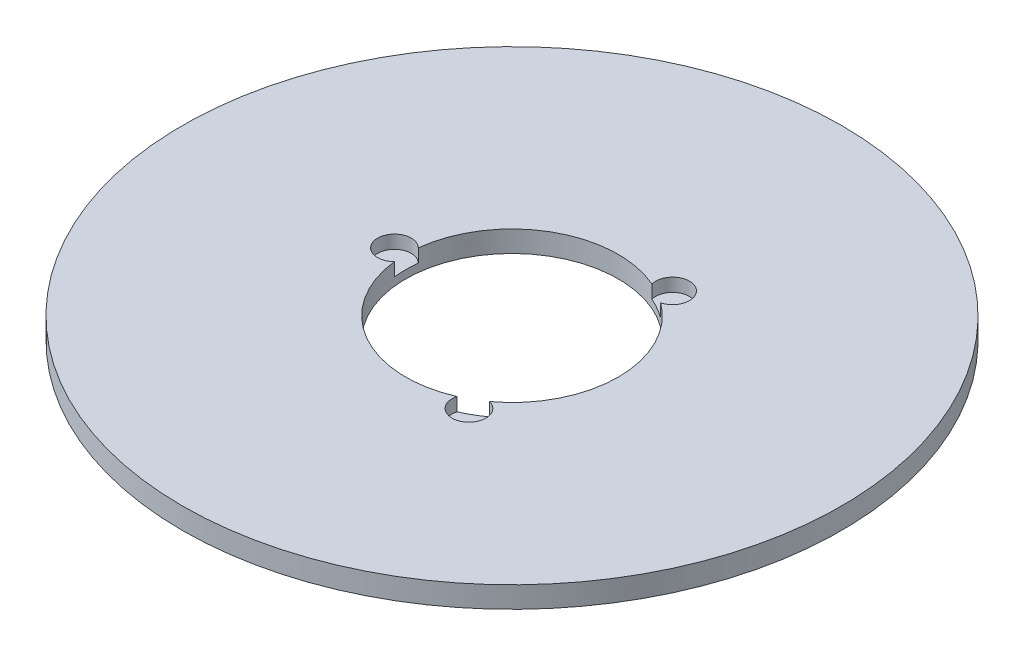
ISO-10303-21;
HEADER;
FILE_DESCRIPTION(('STEP AP214'),'2;1');
FILE_NAME('part.step','',(''),(''),'','','');
FILE_SCHEMA(('AUTOMOTIVE_DESIGN { 1 0 10303 214 1 1 1 1 }'));
ENDSEC;
DATA;
#1=APPLICATION_CONTEXT('core data for automotive mechanical design processes');
#2=APPLICATION_PROTOCOL_DEFINITION('international standard','automotive_design',2000,#1);
#3=PRODUCT_CONTEXT('',#1,'mechanical');
#4=PRODUCT('Part','Part','',(#3));
#5=PRODUCT_RELATED_PRODUCT_CATEGORY('part','',(#4));
#6=PRODUCT_DEFINITION_FORMATION('','',#4);
#7=PRODUCT_DEFINITION_CONTEXT('part definition',#1,'design');
#8=PRODUCT_DEFINITION('design','',#6,#7);
#9=PRODUCT_DEFINITION_SHAPE('','',#8);
#10=(LENGTH_UNIT() NAMED_UNIT(*) SI_UNIT(.MILLI.,.METRE.));
#11=(NAMED_UNIT(*) PLANE_ANGLE_UNIT() SI_UNIT($,.RADIAN.));
#12=(NAMED_UNIT(*) SI_UNIT($,.STERADIAN.) SOLID_ANGLE_UNIT());
#13=UNCERTAINTY_MEASURE_WITH_UNIT(LENGTH_MEASURE(1.E-05),#10,'distance_accuracy_value','');
#14=(GEOMETRIC_REPRESENTATION_CONTEXT(3) GLOBAL_UNCERTAINTY_ASSIGNED_CONTEXT((#13)) GLOBAL_UNIT_ASSIGNED_CONTEXT((#10,
#11,#12)) REPRESENTATION_CONTEXT('',''));
#15=CARTESIAN_POINT('',(0.,0.,0.));
#16=DIRECTION('',(0.,0.,1.));
#17=DIRECTION('',(1.,0.,0.));
#18=AXIS2_PLACEMENT_3D('',#15,#16,#17);
#19=CARTESIAN_POINT('',(0.,5.,0.));
#20=DIRECTION('',(0.,-1.,0.));
#21=DIRECTION('',(0.,0.,-1.));
#22=AXIS2_PLACEMENT_3D('',#19,#20,#21);
#23=CYLINDRICAL_SURFACE('',#22,77.5);
#24=CARTESIAN_POINT('',(0.,5.,0.));
#25=DIRECTION('',(0.,1.,0.));
#26=DIRECTION('',(0.,0.,1.));
#27=AXIS2_PLACEMENT_3D('',#24,#25,#26);
#28=CIRCLE('',#27,77.5);
#29=CARTESIAN_POINT('',(0.,5.,77.5));
#30=VERTEX_POINT('',#29);
#31=EDGE_CURVE('E126',#30,#30,#28,.T.);
#32=ORIENTED_EDGE('',*,*,#31,.F.);
#33=EDGE_LOOP('',(#32));
#34=FACE_BOUND('',#33,.T.);
#35=CARTESIAN_POINT('',(0.,0.,0.));
#36=DIRECTION('',(0.,1.,0.));
#37=DIRECTION('',(0.,0.,1.));
#38=AXIS2_PLACEMENT_3D('',#35,#36,#37);
#39=CIRCLE('',#38,77.5);
#40=CARTESIAN_POINT('',(0.,0.,77.5));
#41=VERTEX_POINT('',#40);
#42=EDGE_CURVE('E124',#41,#41,#39,.T.);
#43=ORIENTED_EDGE('',*,*,#42,.T.);
#44=EDGE_LOOP('',(#43));
#45=FACE_BOUND('',#44,.T.);
#46=ADVANCED_FACE('F39',(#34,#45),#23,.T.);
#47=CARTESIAN_POINT('',(0.,5.,0.));
#48=DIRECTION('',(0.,1.,0.));
#49=DIRECTION('',(0.,0.,1.));
#50=AXIS2_PLACEMENT_3D('',#47,#48,#49);
#51=PLANE('',#50);
#52=CARTESIAN_POINT('',(13.8231584113767,5.,23.9424126895773));
#53=DIRECTION('',(0.,1.,0.));
#54=DIRECTION('',(0.866025403784436,0.,-0.500000000000004));
#55=AXIS2_PLACEMENT_3D('',#52,#53,#54);
#56=CIRCLE('',#55,3.96825472436484);
#57=CARTESIAN_POINT('',(9.98956244592138,5.,22.917430967258));
#58=VERTEX_POINT('',#57);
#59=CARTESIAN_POINT('',(14.8522961841611,5.,20.1099303344878));
#60=VERTEX_POINT('',#59);
#61=EDGE_CURVE('E147',#58,#60,#56,.T.);
#62=ORIENTED_EDGE('',*,*,#61,.F.);
#63=CARTESIAN_POINT('',(0.,5.,0.));
#64=DIRECTION('',(0.,1.,0.));
#65=DIRECTION('',(0.,0.,1.));
#66=AXIS2_PLACEMENT_3D('',#63,#64,#65);
#67=CIRCLE('',#66,25.);
#68=CARTESIAN_POINT('',(-24.8418586300823,5.,2.8075006327702));
#69=VERTEX_POINT('',#68);
#70=EDGE_CURVE('E118',#69,#58,#67,.T.);
#71=ORIENTED_EDGE('',*,*,#70,.F.);
#72=CARTESIAN_POINT('',(-27.6463168227532,5.,0.));
#73=DIRECTION('',(0.,1.,0.));
#74=DIRECTION('',(0.,0.,1.));
#75=AXIS2_PLACEMENT_3D('',#72,#73,#74);
#76=CIRCLE('',#75,3.96825472436484);
#77=CARTESIAN_POINT('',(-24.8418586300823,5.,-2.8075006327702));
#78=VERTEX_POINT('',#77);
#79=EDGE_CURVE('E113',#78,#69,#76,.T.);
#80=ORIENTED_EDGE('',*,*,#79,.F.);
#81=CARTESIAN_POINT('',(9.98956244592106,5.,-22.9174309672582));
#82=VERTEX_POINT('',#81);
#83=EDGE_CURVE('E106',#82,#78,#67,.T.);
#84=ORIENTED_EDGE('',*,*,#83,.F.);
#85=CARTESIAN_POINT('',(13.8231584113764,5.,-23.9424126895775));
#86=DIRECTION('',(0.,1.,0.));
#87=DIRECTION('',(-0.866025403784443,0.,-0.499999999999992));
#88=AXIS2_PLACEMENT_3D('',#85,#86,#87);
#89=CIRCLE('',#88,3.96825472436484);
#90=CARTESIAN_POINT('',(14.8522961841609,5.,-20.109930334488));
#91=VERTEX_POINT('',#90);
#92=EDGE_CURVE('E90',#91,#82,#89,.T.);
#93=ORIENTED_EDGE('',*,*,#92,.F.);
#94=EDGE_CURVE('E116',#60,#91,#67,.T.);
#95=ORIENTED_EDGE('',*,*,#94,.F.);
#96=EDGE_LOOP('',(#62,#71,#80,#84,#93,#95));
#97=FACE_BOUND('',#96,.T.);
#98=ORIENTED_EDGE('',*,*,#31,.T.);
#99=EDGE_LOOP('',(#98));
#100=FACE_BOUND('',#99,.T.);
#101=ADVANCED_FACE('F115',(#97,#100),#51,.T.);
#102=CARTESIAN_POINT('',(0.,0.,0.));
#103=DIRECTION('',(0.,1.,0.));
#104=DIRECTION('',(0.,0.,1.));
#105=AXIS2_PLACEMENT_3D('',#102,#103,#104);
#106=PLANE('',#105);
#107=CARTESIAN_POINT('',(0.,0.,0.));
#108=DIRECTION('',(0.,1.,0.));
#109=DIRECTION('',(0.,0.,1.));
#110=AXIS2_PLACEMENT_3D('',#107,#108,#109);
#111=CIRCLE('',#110,25.);
#112=CARTESIAN_POINT('',(0.,0.,25.));
#113=VERTEX_POINT('',#112);
#114=EDGE_CURVE('E120',#113,#113,#111,.T.);
#115=ORIENTED_EDGE('',*,*,#114,.T.);
#116=EDGE_LOOP('',(#115));
#117=FACE_BOUND('',#116,.T.);
#118=ORIENTED_EDGE('',*,*,#42,.F.);
#119=EDGE_LOOP('',(#118));
#120=FACE_BOUND('',#119,.T.);
#121=ADVANCED_FACE('F164',(#117,#120),#106,.F.);
#122=CARTESIAN_POINT('',(0.,5.,0.));
#123=DIRECTION('',(0.,-1.,0.));
#124=DIRECTION('',(0.,0.,-1.));
#125=AXIS2_PLACEMENT_3D('',#122,#123,#124);
#126=CYLINDRICAL_SURFACE('',#125,25.);
#127=DIRECTION('',(0.,1.,0.));
#128=VECTOR('',#127,1.);
#129=CARTESIAN_POINT('',(9.98956244592138,3.44371767161285,22.917430967258));
#130=LINE('',#129,#128);
#131=CARTESIAN_POINT('',(9.98956244592138,1.88743534322571,22.917430967258));
#132=VERTEX_POINT('',#131);
#133=EDGE_CURVE('E11',#132,#58,#130,.T.);
#134=ORIENTED_EDGE('',*,*,#133,.F.);
#135=CARTESIAN_POINT('',(0.,1.88743534322571,0.));
#136=DIRECTION('',(0.,1.,0.));
#137=DIRECTION('',(0.,0.,1.));
#138=AXIS2_PLACEMENT_3D('',#135,#136,#137);
#139=CIRCLE('',#138,25.);
#140=CARTESIAN_POINT('',(14.8522961841611,1.88743534322571,20.1099303344878));
#141=VERTEX_POINT('',#140);
#142=EDGE_CURVE('E144',#132,#141,#139,.T.);
#143=ORIENTED_EDGE('',*,*,#142,.T.);
#144=DIRECTION('',(0.,1.,0.));
#145=VECTOR('',#144,1.);
#146=CARTESIAN_POINT('',(14.8522961841611,3.44371767161285,20.1099303344878));
#147=LINE('',#146,#145);
#148=EDGE_CURVE('E46',#60,#141,#147,.F.);
#149=ORIENTED_EDGE('',*,*,#148,.F.);
#150=ORIENTED_EDGE('',*,*,#94,.T.);
#151=DIRECTION('',(0.,1.,0.));
#152=VECTOR('',#151,1.);
#153=CARTESIAN_POINT('',(14.8522961841609,3.44371767161285,-20.109930334488));
#154=LINE('',#153,#152);
#155=CARTESIAN_POINT('',(14.8522961841609,1.88743534322571,-20.109930334488));
#156=VERTEX_POINT('',#155);
#157=EDGE_CURVE('E92',#156,#91,#154,.T.);
#158=ORIENTED_EDGE('',*,*,#157,.F.);
#159=CARTESIAN_POINT('',(0.,1.88743534322571,0.));
#160=DIRECTION('',(0.,1.,0.));
#161=DIRECTION('',(0.,0.,1.));
#162=AXIS2_PLACEMENT_3D('',#159,#160,#161);
#163=CIRCLE('',#162,25.);
#164=CARTESIAN_POINT('',(9.98956244592106,1.88743534322571,-22.9174309672582));
#165=VERTEX_POINT('',#164);
#166=EDGE_CURVE('E107',#156,#165,#163,.T.);
#167=ORIENTED_EDGE('',*,*,#166,.T.);
#168=DIRECTION('',(0.,1.,0.));
#169=VECTOR('',#168,1.);
#170=CARTESIAN_POINT('',(9.98956244592106,3.44371767161285,-22.9174309672582));
#171=LINE('',#170,#169);
#172=EDGE_CURVE('E95',#82,#165,#171,.F.);
#173=ORIENTED_EDGE('',*,*,#172,.F.);
#174=ORIENTED_EDGE('',*,*,#83,.T.);
#175=DIRECTION('',(0.,1.,0.));
#176=VECTOR('',#175,1.);
#177=CARTESIAN_POINT('',(-24.8418586300823,3.44371767161285,-2.80750063277021));
#178=LINE('',#177,#176);
#179=CARTESIAN_POINT('',(-24.8418586300823,1.88743534322571,-2.8075006327702));
#180=VERTEX_POINT('',#179);
#181=EDGE_CURVE('E143',#180,#78,#178,.T.);
#182=ORIENTED_EDGE('',*,*,#181,.F.);
#183=CARTESIAN_POINT('',(0.,1.88743534322571,0.));
#184=DIRECTION('',(0.,1.,0.));
#185=DIRECTION('',(0.,0.,1.));
#186=AXIS2_PLACEMENT_3D('',#183,#184,#185);
#187=CIRCLE('',#186,25.);
#188=CARTESIAN_POINT('',(-24.8418586300823,1.88743534322571,2.8075006327702));
#189=VERTEX_POINT('',#188);
#190=EDGE_CURVE('E132',#180,#189,#187,.T.);
#191=ORIENTED_EDGE('',*,*,#190,.T.);
#192=DIRECTION('',(0.,1.,0.));
#193=VECTOR('',#192,1.);
#194=CARTESIAN_POINT('',(-24.8418586300823,3.44371767161285,2.80750063277021));
#195=LINE('',#194,#193);
#196=EDGE_CURVE('E137',#69,#189,#195,.F.);
#197=ORIENTED_EDGE('',*,*,#196,.F.);
#198=ORIENTED_EDGE('',*,*,#70,.T.);
#199=EDGE_LOOP('',(#134,#143,#149,#150,#158,#167,#173,#174,#182,#191,#197,#198));
#200=FACE_BOUND('',#199,.T.);
#201=ORIENTED_EDGE('',*,*,#114,.F.);
#202=EDGE_LOOP('',(#201));
#203=FACE_BOUND('',#202,.T.);
#204=ADVANCED_FACE('F103',(#200,#203),#126,.F.);
#205=CARTESIAN_POINT('',(-27.6463168227532,1.88743534322571,0.));
#206=DIRECTION('',(0.,1.,0.));
#207=DIRECTION('',(0.,0.,1.));
#208=AXIS2_PLACEMENT_3D('',#205,#206,#207);
#209=CYLINDRICAL_SURFACE('',#208,3.96825472436484);
#210=ORIENTED_EDGE('',*,*,#181,.T.);
#211=ORIENTED_EDGE('',*,*,#79,.T.);
#212=ORIENTED_EDGE('',*,*,#196,.T.);
#213=CARTESIAN_POINT('',(-27.6463168227532,1.88743534322571,0.));
#214=DIRECTION('',(0.,1.,0.));
#215=DIRECTION('',(0.,0.,1.));
#216=AXIS2_PLACEMENT_3D('',#213,#214,#215);
#217=CIRCLE('',#216,3.96825472436484);
#218=EDGE_CURVE('E121',#180,#189,#217,.T.);
#219=ORIENTED_EDGE('',*,*,#218,.F.);
#220=EDGE_LOOP('',(#210,#211,#212,#219));
#221=FACE_BOUND('',#220,.T.);
#222=ADVANCED_FACE('F174',(#221),#209,.F.);
#223=CARTESIAN_POINT('',(-27.6463168227532,1.88743534322571,0.));
#224=DIRECTION('',(0.,1.,0.));
#225=DIRECTION('',(0.,0.,1.));
#226=AXIS2_PLACEMENT_3D('',#223,#224,#225);
#227=PLANE('',#226);
#228=ORIENTED_EDGE('',*,*,#218,.T.);
#229=ORIENTED_EDGE('',*,*,#190,.F.);
#230=EDGE_LOOP('',(#228,#229));
#231=FACE_BOUND('',#230,.T.);
#232=ADVANCED_FACE('F177',(#231),#227,.T.);
#233=CARTESIAN_POINT('',(13.8231584113764,1.88743534322571,-23.9424126895775));
#234=DIRECTION('',(0.,1.,0.));
#235=DIRECTION('',(0.,0.,1.));
#236=AXIS2_PLACEMENT_3D('',#233,#234,#235);
#237=CYLINDRICAL_SURFACE('',#236,3.96825472436484);
#238=ORIENTED_EDGE('',*,*,#157,.T.);
#239=ORIENTED_EDGE('',*,*,#92,.T.);
#240=ORIENTED_EDGE('',*,*,#172,.T.);
#241=CARTESIAN_POINT('',(13.8231584113764,1.88743534322571,-23.9424126895775));
#242=DIRECTION('',(0.,1.,0.));
#243=DIRECTION('',(-0.866025403784443,0.,-0.499999999999992));
#244=AXIS2_PLACEMENT_3D('',#241,#242,#243);
#245=CIRCLE('',#244,3.96825472436484);
#246=EDGE_CURVE('E56',#156,#165,#245,.T.);
#247=ORIENTED_EDGE('',*,*,#246,.F.);
#248=EDGE_LOOP('',(#238,#239,#240,#247));
#249=FACE_BOUND('',#248,.T.);
#250=ADVANCED_FACE('F93',(#249),#237,.F.);
#251=CARTESIAN_POINT('',(13.8231584113764,1.88743534322571,-23.9424126895775));
#252=DIRECTION('',(0.,1.,0.));
#253=DIRECTION('',(-0.866025403784443,0.,-0.499999999999992));
#254=AXIS2_PLACEMENT_3D('',#251,#252,#253);
#255=PLANE('',#254);
#256=ORIENTED_EDGE('',*,*,#246,.T.);
#257=ORIENTED_EDGE('',*,*,#166,.F.);
#258=EDGE_LOOP('',(#256,#257));
#259=FACE_BOUND('',#258,.T.);
#260=ADVANCED_FACE('F160',(#259),#255,.T.);
#261=CARTESIAN_POINT('',(13.8231584113767,1.88743534322571,23.9424126895773));
#262=DIRECTION('',(0.,1.,0.));
#263=DIRECTION('',(0.,0.,1.));
#264=AXIS2_PLACEMENT_3D('',#261,#262,#263);
#265=CYLINDRICAL_SURFACE('',#264,3.96825472436484);
#266=ORIENTED_EDGE('',*,*,#133,.T.);
#267=ORIENTED_EDGE('',*,*,#61,.T.);
#268=ORIENTED_EDGE('',*,*,#148,.T.);
#269=CARTESIAN_POINT('',(13.8231584113767,1.88743534322571,23.9424126895773));
#270=DIRECTION('',(0.,1.,0.));
#271=DIRECTION('',(0.866025403784436,0.,-0.500000000000004));
#272=AXIS2_PLACEMENT_3D('',#269,#270,#271);
#273=CIRCLE('',#272,3.96825472436484);
#274=EDGE_CURVE('E55',#132,#141,#273,.T.);
#275=ORIENTED_EDGE('',*,*,#274,.F.);
#276=EDGE_LOOP('',(#266,#267,#268,#275));
#277=FACE_BOUND('',#276,.T.);
#278=ADVANCED_FACE('F149',(#277),#265,.F.);
#279=CARTESIAN_POINT('',(13.8231584113767,1.88743534322571,23.9424126895773));
#280=DIRECTION('',(0.,1.,0.));
#281=DIRECTION('',(0.866025403784436,0.,-0.500000000000004));
#282=AXIS2_PLACEMENT_3D('',#279,#280,#281);
#283=PLANE('',#282);
#284=ORIENTED_EDGE('',*,*,#274,.T.);
#285=ORIENTED_EDGE('',*,*,#142,.F.);
#286=EDGE_LOOP('',(#284,#285));
#287=FACE_BOUND('',#286,.T.);
#288=ADVANCED_FACE('F151',(#287),#283,.T.);
#289=CLOSED_SHELL('',(#46,#101,#121,#204,#222,#232,#250,#260,#278,#288));
#290=MANIFOLD_SOLID_BREP('B2',#289);
#291=ADVANCED_BREP_SHAPE_REPRESENTATION('',(#18,#290),#14);
#292=SHAPE_DEFINITION_REPRESENTATION(#9,#291);
ENDSEC;
END-ISO-10303-21;
